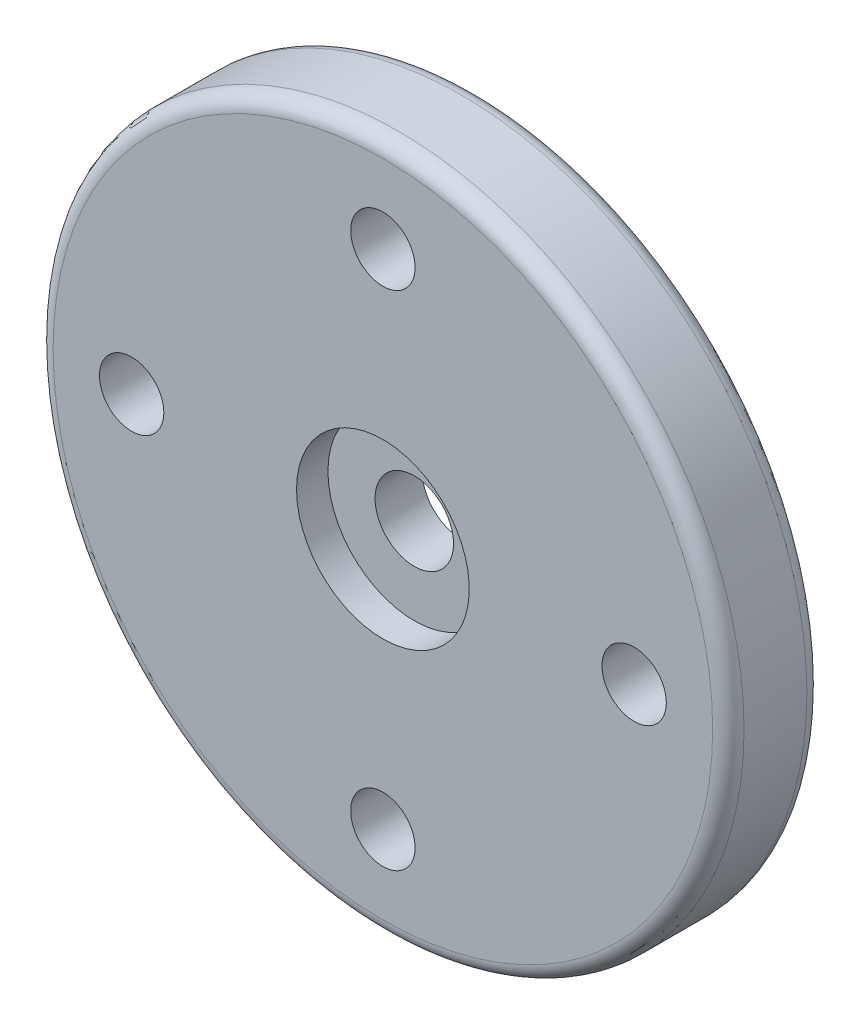
ISO-10303-21;
HEADER;
FILE_DESCRIPTION(('STEP AP214'),'2;1');
FILE_NAME('part.step','',(''),(''),'','','');
FILE_SCHEMA(('AUTOMOTIVE_DESIGN { 1 0 10303 214 1 1 1 1 }'));
ENDSEC;
DATA;
#1=APPLICATION_CONTEXT('core data for automotive mechanical design processes');
#2=APPLICATION_PROTOCOL_DEFINITION('international standard','automotive_design',2000,#1);
#3=PRODUCT_CONTEXT('',#1,'mechanical');
#4=PRODUCT('Part','Part','',(#3));
#5=PRODUCT_RELATED_PRODUCT_CATEGORY('part','',(#4));
#6=PRODUCT_DEFINITION_FORMATION('','',#4);
#7=PRODUCT_DEFINITION_CONTEXT('part definition',#1,'design');
#8=PRODUCT_DEFINITION('design','',#6,#7);
#9=PRODUCT_DEFINITION_SHAPE('','',#8);
#10=(LENGTH_UNIT() NAMED_UNIT(*) SI_UNIT(.MILLI.,.METRE.));
#11=(NAMED_UNIT(*) PLANE_ANGLE_UNIT() SI_UNIT($,.RADIAN.));
#12=(NAMED_UNIT(*) SI_UNIT($,.STERADIAN.) SOLID_ANGLE_UNIT());
#13=UNCERTAINTY_MEASURE_WITH_UNIT(LENGTH_MEASURE(1.E-05),#10,'distance_accuracy_value','');
#14=(GEOMETRIC_REPRESENTATION_CONTEXT(3) GLOBAL_UNCERTAINTY_ASSIGNED_CONTEXT((#13)) GLOBAL_UNIT_ASSIGNED_CONTEXT((#10,
#11,#12)) REPRESENTATION_CONTEXT('',''));
#15=CARTESIAN_POINT('',(0.,0.,0.));
#16=DIRECTION('',(0.,0.,1.));
#17=DIRECTION('',(1.,0.,0.));
#18=AXIS2_PLACEMENT_3D('',#15,#16,#17);
#19=CARTESIAN_POINT('',(0.,0.,0.));
#20=DIRECTION('',(0.,0.,-1.));
#21=DIRECTION('',(-1.,0.,0.));
#22=AXIS2_PLACEMENT_3D('',#19,#20,#21);
#23=CYLINDRICAL_SURFACE('',#22,2.75);
#24=CARTESIAN_POINT('',(0.,0.,-1.));
#25=DIRECTION('',(0.,0.,-1.));
#26=DIRECTION('',(-1.,0.,0.));
#27=AXIS2_PLACEMENT_3D('',#24,#25,#26);
#28=CIRCLE('',#27,2.75);
#29=CARTESIAN_POINT('',(-2.75,0.,-1.));
#30=VERTEX_POINT('',#29);
#31=EDGE_CURVE('E67',#30,#30,#28,.T.);
#32=ORIENTED_EDGE('',*,*,#31,.T.);
#33=EDGE_LOOP('',(#32));
#34=FACE_BOUND('',#33,.T.);
#35=CARTESIAN_POINT('',(0.,0.,0.));
#36=DIRECTION('',(0.,0.,-1.));
#37=DIRECTION('',(-1.,0.,0.));
#38=AXIS2_PLACEMENT_3D('',#35,#36,#37);
#39=CIRCLE('',#38,2.75);
#40=CARTESIAN_POINT('',(-2.75,0.,0.));
#41=VERTEX_POINT('',#40);
#42=EDGE_CURVE('E52',#41,#41,#39,.T.);
#43=ORIENTED_EDGE('',*,*,#42,.F.);
#44=EDGE_LOOP('',(#43));
#45=FACE_BOUND('',#44,.T.);
#46=ADVANCED_FACE('F32',(#34,#45),#23,.F.);
#47=CARTESIAN_POINT('',(0.,2.75,0.));
#48=DIRECTION('',(0.,0.,1.));
#49=DIRECTION('',(1.,0.,0.));
#50=AXIS2_PLACEMENT_3D('',#47,#48,#49);
#51=PLANE('',#50);
#52=CARTESIAN_POINT('',(0.,0.,0.));
#53=DIRECTION('',(0.,0.,1.));
#54=DIRECTION('',(1.,0.,0.));
#55=AXIS2_PLACEMENT_3D('',#52,#53,#54);
#56=CIRCLE('',#55,10.5);
#57=CARTESIAN_POINT('',(10.5,0.,0.));
#58=VERTEX_POINT('',#57);
#59=EDGE_CURVE('E10',#58,#58,#56,.T.);
#60=ORIENTED_EDGE('',*,*,#59,.T.);
#61=EDGE_LOOP('',(#60));
#62=FACE_BOUND('',#61,.T.);
#63=CARTESIAN_POINT('',(0.,8.,0.));
#64=DIRECTION('',(0.,0.,1.));
#65=DIRECTION('',(1.,0.,0.));
#66=AXIS2_PLACEMENT_3D('',#63,#64,#65);
#67=CIRCLE('',#66,1.025);
#68=CARTESIAN_POINT('',(1.025,8.,0.));
#69=VERTEX_POINT('',#68);
#70=EDGE_CURVE('E73',#69,#69,#67,.T.);
#71=ORIENTED_EDGE('',*,*,#70,.F.);
#72=EDGE_LOOP('',(#71));
#73=FACE_BOUND('',#72,.T.);
#74=CARTESIAN_POINT('',(8.,0.,0.));
#75=DIRECTION('',(0.,0.,1.));
#76=DIRECTION('',(1.,0.,0.));
#77=AXIS2_PLACEMENT_3D('',#74,#75,#76);
#78=CIRCLE('',#77,1.025);
#79=CARTESIAN_POINT('',(9.025,0.,0.));
#80=VERTEX_POINT('',#79);
#81=EDGE_CURVE('E85',#80,#80,#78,.T.);
#82=ORIENTED_EDGE('',*,*,#81,.F.);
#83=EDGE_LOOP('',(#82));
#84=FACE_BOUND('',#83,.T.);
#85=CARTESIAN_POINT('',(0.,-8.,0.));
#86=DIRECTION('',(0.,0.,1.));
#87=DIRECTION('',(1.,0.,0.));
#88=AXIS2_PLACEMENT_3D('',#85,#86,#87);
#89=CIRCLE('',#88,1.025);
#90=CARTESIAN_POINT('',(1.025,-8.,0.));
#91=VERTEX_POINT('',#90);
#92=EDGE_CURVE('E91',#91,#91,#89,.T.);
#93=ORIENTED_EDGE('',*,*,#92,.F.);
#94=EDGE_LOOP('',(#93));
#95=FACE_BOUND('',#94,.T.);
#96=CARTESIAN_POINT('',(-8.,0.,0.));
#97=DIRECTION('',(0.,0.,1.));
#98=DIRECTION('',(1.,0.,0.));
#99=AXIS2_PLACEMENT_3D('',#96,#97,#98);
#100=CIRCLE('',#99,1.025);
#101=CARTESIAN_POINT('',(-6.975,0.,0.));
#102=VERTEX_POINT('',#101);
#103=EDGE_CURVE('E79',#102,#102,#100,.T.);
#104=ORIENTED_EDGE('',*,*,#103,.F.);
#105=EDGE_LOOP('',(#104));
#106=FACE_BOUND('',#105,.T.);
#107=ORIENTED_EDGE('',*,*,#42,.T.);
#108=EDGE_LOOP('',(#107));
#109=FACE_BOUND('',#108,.T.);
#110=ADVANCED_FACE('F98',(#62,#73,#84,#95,#106,#109),#51,.T.);
#111=CARTESIAN_POINT('',(0.,0.,0.));
#112=DIRECTION('',(0.,0.,-1.));
#113=DIRECTION('',(-1.,0.,0.));
#114=AXIS2_PLACEMENT_3D('',#111,#112,#113);
#115=CYLINDRICAL_SURFACE('',#114,11.);
#116=CARTESIAN_POINT('',(0.,0.,-2.5));
#117=DIRECTION('',(0.,0.,-1.));
#118=DIRECTION('',(-1.,0.,0.));
#119=AXIS2_PLACEMENT_3D('',#116,#117,#118);
#120=CIRCLE('',#119,11.);
#121=CARTESIAN_POINT('',(-11.,0.,-2.5));
#122=VERTEX_POINT('',#121);
#123=EDGE_CURVE('E39',#122,#122,#120,.F.);
#124=ORIENTED_EDGE('',*,*,#123,.T.);
#125=EDGE_LOOP('',(#124));
#126=FACE_BOUND('',#125,.T.);
#127=CARTESIAN_POINT('',(0.,0.,-0.5));
#128=DIRECTION('',(0.,0.,1.));
#129=DIRECTION('',(1.,0.,0.));
#130=AXIS2_PLACEMENT_3D('',#127,#128,#129);
#131=CIRCLE('',#130,11.);
#132=CARTESIAN_POINT('',(11.,0.,-0.5));
#133=VERTEX_POINT('',#132);
#134=EDGE_CURVE('E43',#133,#133,#131,.F.);
#135=ORIENTED_EDGE('',*,*,#134,.T.);
#136=EDGE_LOOP('',(#135));
#137=FACE_BOUND('',#136,.T.);
#138=ADVANCED_FACE('F101',(#126,#137),#115,.T.);
#139=CARTESIAN_POINT('',(0.,11.,-3.));
#140=DIRECTION('',(0.,0.,-1.));
#141=DIRECTION('',(-1.,0.,0.));
#142=AXIS2_PLACEMENT_3D('',#139,#140,#141);
#143=PLANE('',#142);
#144=CARTESIAN_POINT('',(0.,0.,-3.));
#145=DIRECTION('',(0.,0.,-1.));
#146=DIRECTION('',(-1.,0.,0.));
#147=AXIS2_PLACEMENT_3D('',#144,#145,#146);
#148=CIRCLE('',#147,10.5);
#149=CARTESIAN_POINT('',(-10.5,0.,-3.));
#150=VERTEX_POINT('',#149);
#151=EDGE_CURVE('E47',#150,#150,#148,.T.);
#152=ORIENTED_EDGE('',*,*,#151,.T.);
#153=EDGE_LOOP('',(#152));
#154=FACE_BOUND('',#153,.T.);
#155=CARTESIAN_POINT('',(0.,8.,-3.));
#156=DIRECTION('',(0.,0.,-1.));
#157=DIRECTION('',(-1.,0.,0.));
#158=AXIS2_PLACEMENT_3D('',#155,#156,#157);
#159=CIRCLE('',#158,1.025);
#160=CARTESIAN_POINT('',(-1.025,8.,-3.));
#161=VERTEX_POINT('',#160);
#162=EDGE_CURVE('E70',#161,#161,#159,.F.);
#163=ORIENTED_EDGE('',*,*,#162,.T.);
#164=EDGE_LOOP('',(#163));
#165=FACE_BOUND('',#164,.T.);
#166=CARTESIAN_POINT('',(8.,0.,-3.));
#167=DIRECTION('',(0.,0.,-1.));
#168=DIRECTION('',(-1.,0.,0.));
#169=AXIS2_PLACEMENT_3D('',#166,#167,#168);
#170=CIRCLE('',#169,1.025);
#171=CARTESIAN_POINT('',(6.975,0.,-3.));
#172=VERTEX_POINT('',#171);
#173=EDGE_CURVE('E82',#172,#172,#170,.F.);
#174=ORIENTED_EDGE('',*,*,#173,.T.);
#175=EDGE_LOOP('',(#174));
#176=FACE_BOUND('',#175,.T.);
#177=CARTESIAN_POINT('',(0.,-8.,-3.));
#178=DIRECTION('',(0.,0.,-1.));
#179=DIRECTION('',(-1.,0.,0.));
#180=AXIS2_PLACEMENT_3D('',#177,#178,#179);
#181=CIRCLE('',#180,1.025);
#182=CARTESIAN_POINT('',(-1.025,-8.,-3.));
#183=VERTEX_POINT('',#182);
#184=EDGE_CURVE('E88',#183,#183,#181,.F.);
#185=ORIENTED_EDGE('',*,*,#184,.T.);
#186=EDGE_LOOP('',(#185));
#187=FACE_BOUND('',#186,.T.);
#188=CARTESIAN_POINT('',(-8.,0.,-3.));
#189=DIRECTION('',(0.,0.,-1.));
#190=DIRECTION('',(-1.,0.,0.));
#191=AXIS2_PLACEMENT_3D('',#188,#189,#190);
#192=CIRCLE('',#191,1.025);
#193=CARTESIAN_POINT('',(-9.025,0.,-3.));
#194=VERTEX_POINT('',#193);
#195=EDGE_CURVE('E76',#194,#194,#192,.F.);
#196=ORIENTED_EDGE('',*,*,#195,.T.);
#197=EDGE_LOOP('',(#196));
#198=FACE_BOUND('',#197,.T.);
#199=CARTESIAN_POINT('',(0.,0.,-3.));
#200=DIRECTION('',(0.,0.,-1.));
#201=DIRECTION('',(-1.,0.,0.));
#202=AXIS2_PLACEMENT_3D('',#199,#200,#201);
#203=CIRCLE('',#202,2.75);
#204=CARTESIAN_POINT('',(-2.75,0.,-3.));
#205=VERTEX_POINT('',#204);
#206=EDGE_CURVE('E55',#205,#205,#203,.T.);
#207=ORIENTED_EDGE('',*,*,#206,.F.);
#208=EDGE_LOOP('',(#207));
#209=FACE_BOUND('',#208,.T.);
#210=ADVANCED_FACE('F129',(#154,#165,#176,#187,#198,#209),#143,.T.);
#211=CARTESIAN_POINT('',(0.,0.,0.));
#212=DIRECTION('',(0.,0.,-1.));
#213=DIRECTION('',(-1.,0.,0.));
#214=AXIS2_PLACEMENT_3D('',#211,#212,#213);
#215=CYLINDRICAL_SURFACE('',#214,2.75);
#216=ORIENTED_EDGE('',*,*,#206,.T.);
#217=EDGE_LOOP('',(#216));
#218=FACE_BOUND('',#217,.T.);
#219=CARTESIAN_POINT('',(0.,0.,-2.5));
#220=DIRECTION('',(0.,0.,-1.));
#221=DIRECTION('',(-1.,0.,0.));
#222=AXIS2_PLACEMENT_3D('',#219,#220,#221);
#223=CIRCLE('',#222,2.75);
#224=CARTESIAN_POINT('',(-2.75,0.,-2.5));
#225=VERTEX_POINT('',#224);
#226=EDGE_CURVE('E58',#225,#225,#223,.T.);
#227=ORIENTED_EDGE('',*,*,#226,.F.);
#228=EDGE_LOOP('',(#227));
#229=FACE_BOUND('',#228,.T.);
#230=ADVANCED_FACE('F132',(#218,#229),#215,.F.);
#231=CARTESIAN_POINT('',(0.,2.75,-2.5));
#232=DIRECTION('',(0.,0.,-1.));
#233=DIRECTION('',(-1.,0.,0.));
#234=AXIS2_PLACEMENT_3D('',#231,#232,#233);
#235=PLANE('',#234);
#236=ORIENTED_EDGE('',*,*,#226,.T.);
#237=EDGE_LOOP('',(#236));
#238=FACE_BOUND('',#237,.T.);
#239=CARTESIAN_POINT('',(0.,0.,-2.5));
#240=DIRECTION('',(0.,0.,-1.));
#241=DIRECTION('',(-1.,0.,0.));
#242=AXIS2_PLACEMENT_3D('',#239,#240,#241);
#243=CIRCLE('',#242,1.25);
#244=CARTESIAN_POINT('',(-1.25,0.,-2.5));
#245=VERTEX_POINT('',#244);
#246=EDGE_CURVE('E61',#245,#245,#243,.T.);
#247=ORIENTED_EDGE('',*,*,#246,.F.);
#248=EDGE_LOOP('',(#247));
#249=FACE_BOUND('',#248,.T.);
#250=ADVANCED_FACE('F146',(#238,#249),#235,.T.);
#251=CARTESIAN_POINT('',(0.,0.,0.));
#252=DIRECTION('',(0.,0.,-1.));
#253=DIRECTION('',(-1.,0.,0.));
#254=AXIS2_PLACEMENT_3D('',#251,#252,#253);
#255=CYLINDRICAL_SURFACE('',#254,1.25);
#256=ORIENTED_EDGE('',*,*,#246,.T.);
#257=EDGE_LOOP('',(#256));
#258=FACE_BOUND('',#257,.T.);
#259=CARTESIAN_POINT('',(0.,0.,-1.));
#260=DIRECTION('',(0.,0.,-1.));
#261=DIRECTION('',(-1.,0.,0.));
#262=AXIS2_PLACEMENT_3D('',#259,#260,#261);
#263=CIRCLE('',#262,1.25);
#264=CARTESIAN_POINT('',(-1.25,0.,-1.));
#265=VERTEX_POINT('',#264);
#266=EDGE_CURVE('E64',#265,#265,#263,.T.);
#267=ORIENTED_EDGE('',*,*,#266,.F.);
#268=EDGE_LOOP('',(#267));
#269=FACE_BOUND('',#268,.T.);
#270=ADVANCED_FACE('F123',(#258,#269),#255,.F.);
#271=CARTESIAN_POINT('',(0.,2.75,-1.));
#272=DIRECTION('',(0.,0.,1.));
#273=DIRECTION('',(1.,0.,0.));
#274=AXIS2_PLACEMENT_3D('',#271,#272,#273);
#275=PLANE('',#274);
#276=ORIENTED_EDGE('',*,*,#266,.T.);
#277=EDGE_LOOP('',(#276));
#278=FACE_BOUND('',#277,.T.);
#279=ORIENTED_EDGE('',*,*,#31,.F.);
#280=EDGE_LOOP('',(#279));
#281=FACE_BOUND('',#280,.T.);
#282=ADVANCED_FACE('F115',(#278,#281),#275,.T.);
#283=CARTESIAN_POINT('',(0.,0.,-2.5));
#284=DIRECTION('',(0.,0.,-1.));
#285=DIRECTION('',(-1.,0.,0.));
#286=AXIS2_PLACEMENT_3D('',#283,#284,#285);
#287=TOROIDAL_SURFACE('',#286,10.5,0.5);
#288=ORIENTED_EDGE('',*,*,#123,.F.);
#289=EDGE_LOOP('',(#288));
#290=FACE_BOUND('',#289,.T.);
#291=ORIENTED_EDGE('',*,*,#151,.F.);
#292=EDGE_LOOP('',(#291));
#293=FACE_BOUND('',#292,.T.);
#294=ADVANCED_FACE('F113',(#290,#293),#287,.T.);
#295=CARTESIAN_POINT('',(0.,0.,-0.5));
#296=DIRECTION('',(0.,0.,1.));
#297=DIRECTION('',(1.,0.,0.));
#298=AXIS2_PLACEMENT_3D('',#295,#296,#297);
#299=TOROIDAL_SURFACE('',#298,10.5,0.5);
#300=ORIENTED_EDGE('',*,*,#59,.F.);
#301=EDGE_LOOP('',(#300));
#302=FACE_BOUND('',#301,.T.);
#303=ORIENTED_EDGE('',*,*,#134,.F.);
#304=EDGE_LOOP('',(#303));
#305=FACE_BOUND('',#304,.T.);
#306=ADVANCED_FACE('F34',(#302,#305),#299,.T.);
#307=CARTESIAN_POINT('',(0.,8.,-10.));
#308=DIRECTION('',(0.,0.,1.));
#309=DIRECTION('',(1.,0.,0.));
#310=AXIS2_PLACEMENT_3D('',#307,#308,#309);
#311=CYLINDRICAL_SURFACE('',#310,1.025);
#312=ORIENTED_EDGE('',*,*,#70,.T.);
#313=EDGE_LOOP('',(#312));
#314=FACE_BOUND('',#313,.T.);
#315=ORIENTED_EDGE('',*,*,#162,.F.);
#316=EDGE_LOOP('',(#315));
#317=FACE_BOUND('',#316,.T.);
#318=ADVANCED_FACE('F121',(#314,#317),#311,.F.);
#319=CARTESIAN_POINT('',(-8.,0.,-10.));
#320=DIRECTION('',(0.,0.,1.));
#321=DIRECTION('',(1.,0.,0.));
#322=AXIS2_PLACEMENT_3D('',#319,#320,#321);
#323=CYLINDRICAL_SURFACE('',#322,1.025);
#324=ORIENTED_EDGE('',*,*,#103,.T.);
#325=EDGE_LOOP('',(#324));
#326=FACE_BOUND('',#325,.T.);
#327=ORIENTED_EDGE('',*,*,#195,.F.);
#328=EDGE_LOOP('',(#327));
#329=FACE_BOUND('',#328,.T.);
#330=ADVANCED_FACE('F227',(#326,#329),#323,.F.);
#331=CARTESIAN_POINT('',(8.,0.,-10.));
#332=DIRECTION('',(0.,0.,1.));
#333=DIRECTION('',(1.,0.,0.));
#334=AXIS2_PLACEMENT_3D('',#331,#332,#333);
#335=CYLINDRICAL_SURFACE('',#334,1.025);
#336=ORIENTED_EDGE('',*,*,#81,.T.);
#337=EDGE_LOOP('',(#336));
#338=FACE_BOUND('',#337,.T.);
#339=ORIENTED_EDGE('',*,*,#173,.F.);
#340=EDGE_LOOP('',(#339));
#341=FACE_BOUND('',#340,.T.);
#342=ADVANCED_FACE('F235',(#338,#341),#335,.F.);
#343=CARTESIAN_POINT('',(0.,-8.,-10.));
#344=DIRECTION('',(0.,0.,1.));
#345=DIRECTION('',(1.,0.,0.));
#346=AXIS2_PLACEMENT_3D('',#343,#344,#345);
#347=CYLINDRICAL_SURFACE('',#346,1.025);
#348=ORIENTED_EDGE('',*,*,#92,.T.);
#349=EDGE_LOOP('',(#348));
#350=FACE_BOUND('',#349,.T.);
#351=ORIENTED_EDGE('',*,*,#184,.F.);
#352=EDGE_LOOP('',(#351));
#353=FACE_BOUND('',#352,.T.);
#354=ADVANCED_FACE('F95',(#350,#353),#347,.F.);
#355=CLOSED_SHELL('',(#46,#110,#138,#210,#230,#250,#270,#282,#294,#306,#318,#330,#342,#354));
#356=MANIFOLD_SOLID_BREP('B2',#355);
#357=ADVANCED_BREP_SHAPE_REPRESENTATION('',(#18,#356),#14);
#358=SHAPE_DEFINITION_REPRESENTATION(#9,#357);
ENDSEC;
END-ISO-10303-21;
